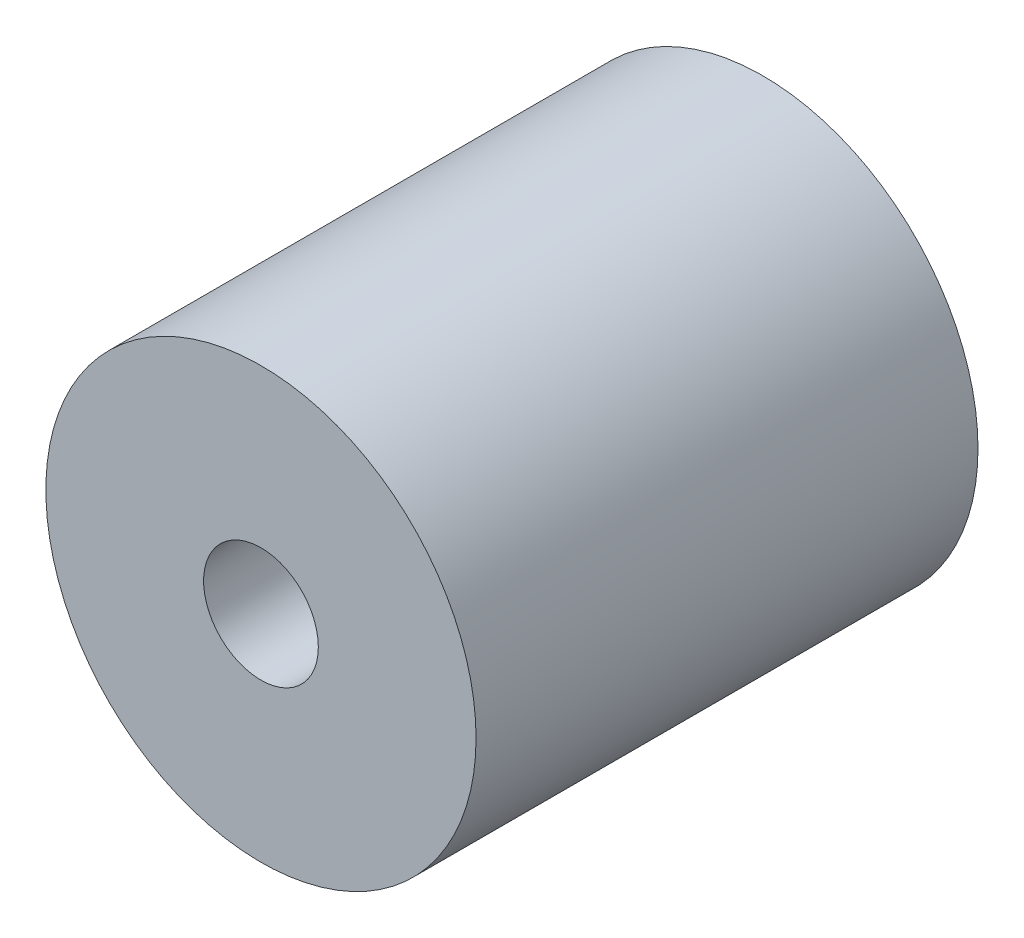
ISO-10303-21;
HEADER;
FILE_DESCRIPTION(('STEP AP214'),'2;1');
FILE_NAME('part.step','',(''),(''),'','','');
FILE_SCHEMA(('AUTOMOTIVE_DESIGN { 1 0 10303 214 1 1 1 1 }'));
ENDSEC;
DATA;
#1=APPLICATION_CONTEXT('core data for automotive mechanical design processes');
#2=APPLICATION_PROTOCOL_DEFINITION('international standard','automotive_design',2000,#1);
#3=PRODUCT_CONTEXT('',#1,'mechanical');
#4=PRODUCT('Part','Part','',(#3));
#5=PRODUCT_RELATED_PRODUCT_CATEGORY('part','',(#4));
#6=PRODUCT_DEFINITION_FORMATION('','',#4);
#7=PRODUCT_DEFINITION_CONTEXT('part definition',#1,'design');
#8=PRODUCT_DEFINITION('design','',#6,#7);
#9=PRODUCT_DEFINITION_SHAPE('','',#8);
#10=(LENGTH_UNIT() NAMED_UNIT(*) SI_UNIT(.MILLI.,.METRE.));
#11=(NAMED_UNIT(*) PLANE_ANGLE_UNIT() SI_UNIT($,.RADIAN.));
#12=(NAMED_UNIT(*) SI_UNIT($,.STERADIAN.) SOLID_ANGLE_UNIT());
#13=UNCERTAINTY_MEASURE_WITH_UNIT(LENGTH_MEASURE(1.E-05),#10,'distance_accuracy_value','');
#14=(GEOMETRIC_REPRESENTATION_CONTEXT(3) GLOBAL_UNCERTAINTY_ASSIGNED_CONTEXT((#13)) GLOBAL_UNIT_ASSIGNED_CONTEXT((#10,
#11,#12)) REPRESENTATION_CONTEXT('',''));
#15=CARTESIAN_POINT('',(0.,0.,0.));
#16=DIRECTION('',(0.,0.,1.));
#17=DIRECTION('',(1.,0.,0.));
#18=AXIS2_PLACEMENT_3D('',#15,#16,#17);
#19=CARTESIAN_POINT('',(0.,0.,35.));
#20=DIRECTION('',(0.,0.,-1.));
#21=DIRECTION('',(-1.,0.,0.));
#22=AXIS2_PLACEMENT_3D('',#19,#20,#21);
#23=CYLINDRICAL_SURFACE('',#22,15.);
#24=CARTESIAN_POINT('',(0.,0.,35.));
#25=DIRECTION('',(0.,0.,1.));
#26=DIRECTION('',(1.,0.,0.));
#27=AXIS2_PLACEMENT_3D('',#24,#25,#26);
#28=CIRCLE('',#27,15.);
#29=CARTESIAN_POINT('',(15.,0.,35.));
#30=VERTEX_POINT('',#29);
#31=EDGE_CURVE('E10',#30,#30,#28,.T.);
#32=ORIENTED_EDGE('',*,*,#31,.F.);
#33=EDGE_LOOP('',(#32));
#34=FACE_BOUND('',#33,.T.);
#35=CARTESIAN_POINT('',(0.,0.,0.));
#36=DIRECTION('',(0.,0.,1.));
#37=DIRECTION('',(1.,0.,0.));
#38=AXIS2_PLACEMENT_3D('',#35,#36,#37);
#39=CIRCLE('',#38,15.);
#40=CARTESIAN_POINT('',(15.,0.,0.));
#41=VERTEX_POINT('',#40);
#42=EDGE_CURVE('E35',#41,#41,#39,.T.);
#43=ORIENTED_EDGE('',*,*,#42,.T.);
#44=EDGE_LOOP('',(#43));
#45=FACE_BOUND('',#44,.T.);
#46=ADVANCED_FACE('F29',(#34,#45),#23,.T.);
#47=CARTESIAN_POINT('',(0.,0.,35.));
#48=DIRECTION('',(0.,0.,1.));
#49=DIRECTION('',(1.,0.,0.));
#50=AXIS2_PLACEMENT_3D('',#47,#48,#49);
#51=PLANE('',#50);
#52=CARTESIAN_POINT('',(0.,0.,35.));
#53=DIRECTION('',(0.,0.,1.));
#54=DIRECTION('',(1.,0.,0.));
#55=AXIS2_PLACEMENT_3D('',#52,#53,#54);
#56=CIRCLE('',#55,4.);
#57=CARTESIAN_POINT('',(4.,0.,35.));
#58=VERTEX_POINT('',#57);
#59=EDGE_CURVE('E43',#58,#58,#56,.T.);
#60=ORIENTED_EDGE('',*,*,#59,.F.);
#61=EDGE_LOOP('',(#60));
#62=FACE_BOUND('',#61,.T.);
#63=ORIENTED_EDGE('',*,*,#31,.T.);
#64=EDGE_LOOP('',(#63));
#65=FACE_BOUND('',#64,.T.);
#66=ADVANCED_FACE('F61',(#62,#65),#51,.T.);
#67=CARTESIAN_POINT('',(0.,0.,0.));
#68=DIRECTION('',(0.,0.,1.));
#69=DIRECTION('',(1.,0.,0.));
#70=AXIS2_PLACEMENT_3D('',#67,#68,#69);
#71=PLANE('',#70);
#72=CARTESIAN_POINT('',(0.,0.,0.));
#73=DIRECTION('',(0.,0.,-1.));
#74=DIRECTION('',(-1.,0.,0.));
#75=AXIS2_PLACEMENT_3D('',#72,#73,#74);
#76=CIRCLE('',#75,6.);
#77=CARTESIAN_POINT('',(-6.,0.,0.));
#78=VERTEX_POINT('',#77);
#79=EDGE_CURVE('E51',#78,#78,#76,.T.);
#80=ORIENTED_EDGE('',*,*,#79,.F.);
#81=EDGE_LOOP('',(#80));
#82=FACE_BOUND('',#81,.T.);
#83=ORIENTED_EDGE('',*,*,#42,.F.);
#84=EDGE_LOOP('',(#83));
#85=FACE_BOUND('',#84,.T.);
#86=ADVANCED_FACE('F57',(#82,#85),#71,.F.);
#87=CARTESIAN_POINT('',(0.,0.,25.));
#88=DIRECTION('',(0.,0.,1.));
#89=DIRECTION('',(1.,0.,0.));
#90=AXIS2_PLACEMENT_3D('',#87,#88,#89);
#91=CYLINDRICAL_SURFACE('',#90,4.);
#92=CARTESIAN_POINT('',(0.,0.,25.));
#93=DIRECTION('',(0.,0.,1.));
#94=DIRECTION('',(1.,0.,0.));
#95=AXIS2_PLACEMENT_3D('',#92,#93,#94);
#96=CIRCLE('',#95,4.);
#97=CARTESIAN_POINT('',(4.,0.,25.));
#98=VERTEX_POINT('',#97);
#99=EDGE_CURVE('E39',#98,#98,#96,.T.);
#100=ORIENTED_EDGE('',*,*,#99,.F.);
#101=EDGE_LOOP('',(#100));
#102=FACE_BOUND('',#101,.T.);
#103=ORIENTED_EDGE('',*,*,#59,.T.);
#104=EDGE_LOOP('',(#103));
#105=FACE_BOUND('',#104,.T.);
#106=ADVANCED_FACE('F60',(#102,#105),#91,.F.);
#107=CARTESIAN_POINT('',(0.,0.,25.));
#108=DIRECTION('',(0.,0.,1.));
#109=DIRECTION('',(1.,0.,0.));
#110=AXIS2_PLACEMENT_3D('',#107,#108,#109);
#111=PLANE('',#110);
#112=ORIENTED_EDGE('',*,*,#99,.T.);
#113=EDGE_LOOP('',(#112));
#114=FACE_BOUND('',#113,.T.);
#115=ADVANCED_FACE('F68',(#114),#111,.T.);
#116=CARTESIAN_POINT('',(0.,0.,10.));
#117=DIRECTION('',(0.,0.,-1.));
#118=DIRECTION('',(-1.,0.,0.));
#119=AXIS2_PLACEMENT_3D('',#116,#117,#118);
#120=CYLINDRICAL_SURFACE('',#119,6.);
#121=CARTESIAN_POINT('',(0.,0.,10.));
#122=DIRECTION('',(0.,0.,-1.));
#123=DIRECTION('',(-1.,0.,0.));
#124=AXIS2_PLACEMENT_3D('',#121,#122,#123);
#125=CIRCLE('',#124,6.);
#126=CARTESIAN_POINT('',(-6.,0.,10.));
#127=VERTEX_POINT('',#126);
#128=EDGE_CURVE('E48',#127,#127,#125,.T.);
#129=ORIENTED_EDGE('',*,*,#128,.F.);
#130=EDGE_LOOP('',(#129));
#131=FACE_BOUND('',#130,.T.);
#132=ORIENTED_EDGE('',*,*,#79,.T.);
#133=EDGE_LOOP('',(#132));
#134=FACE_BOUND('',#133,.T.);
#135=ADVANCED_FACE('F55',(#131,#134),#120,.F.);
#136=CARTESIAN_POINT('',(0.,0.,10.));
#137=DIRECTION('',(0.,0.,-1.));
#138=DIRECTION('',(-1.,0.,0.));
#139=AXIS2_PLACEMENT_3D('',#136,#137,#138);
#140=PLANE('',#139);
#141=ORIENTED_EDGE('',*,*,#128,.T.);
#142=EDGE_LOOP('',(#141));
#143=FACE_BOUND('',#142,.T.);
#144=ADVANCED_FACE('F97',(#143),#140,.T.);
#145=CLOSED_SHELL('',(#46,#66,#86,#106,#115,#135,#144));
#146=MANIFOLD_SOLID_BREP('B2',#145);
#147=ADVANCED_BREP_SHAPE_REPRESENTATION('',(#18,#146),#14);
#148=SHAPE_DEFINITION_REPRESENTATION(#9,#147);
ENDSEC;
END-ISO-10303-21;
